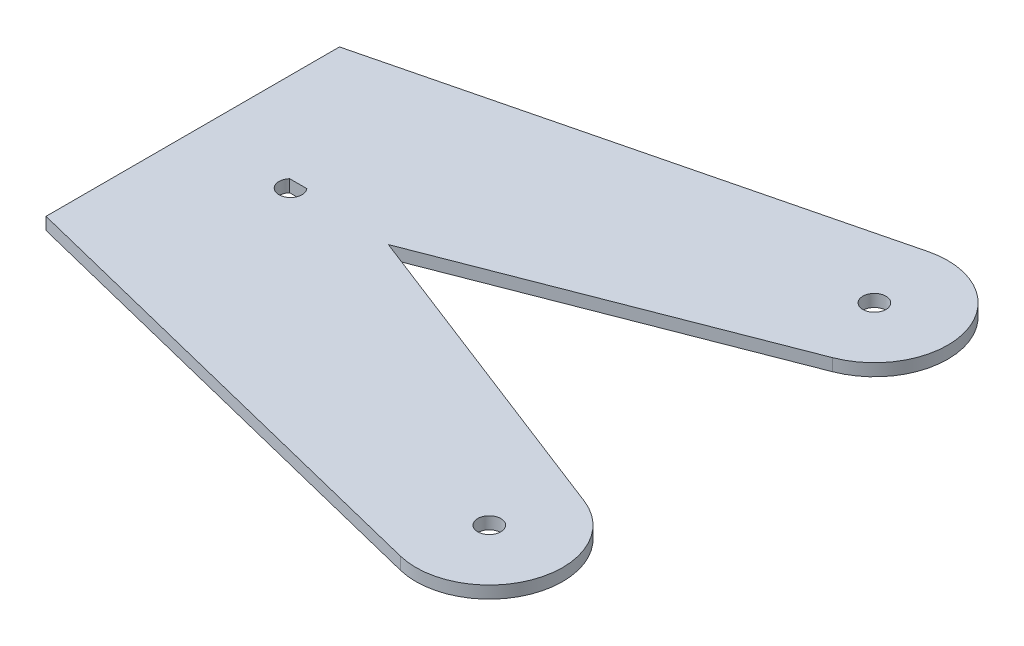
ISO-10303-21;
HEADER;
FILE_DESCRIPTION(('STEP AP214'),'2;1');
FILE_NAME('part.step','',(''),(''),'','','');
FILE_SCHEMA(('AUTOMOTIVE_DESIGN { 1 0 10303 214 1 1 1 1 }'));
ENDSEC;
DATA;
#1=APPLICATION_CONTEXT('core data for automotive mechanical design processes');
#2=APPLICATION_PROTOCOL_DEFINITION('international standard','automotive_design',2000,#1);
#3=PRODUCT_CONTEXT('',#1,'mechanical');
#4=PRODUCT('Part','Part','',(#3));
#5=PRODUCT_RELATED_PRODUCT_CATEGORY('part','',(#4));
#6=PRODUCT_DEFINITION_FORMATION('','',#4);
#7=PRODUCT_DEFINITION_CONTEXT('part definition',#1,'design');
#8=PRODUCT_DEFINITION('design','',#6,#7);
#9=PRODUCT_DEFINITION_SHAPE('','',#8);
#10=(LENGTH_UNIT() NAMED_UNIT(*) SI_UNIT(.MILLI.,.METRE.));
#11=(NAMED_UNIT(*) PLANE_ANGLE_UNIT() SI_UNIT($,.RADIAN.));
#12=(NAMED_UNIT(*) SI_UNIT($,.STERADIAN.) SOLID_ANGLE_UNIT());
#13=UNCERTAINTY_MEASURE_WITH_UNIT(LENGTH_MEASURE(1.E-05),#10,'distance_accuracy_value','');
#14=(GEOMETRIC_REPRESENTATION_CONTEXT(3) GLOBAL_UNCERTAINTY_ASSIGNED_CONTEXT((#13)) GLOBAL_UNIT_ASSIGNED_CONTEXT((#10,
#11,#12)) REPRESENTATION_CONTEXT('',''));
#15=CARTESIAN_POINT('',(0.,0.,0.));
#16=DIRECTION('',(0.,0.,1.));
#17=DIRECTION('',(1.,0.,0.));
#18=AXIS2_PLACEMENT_3D('',#15,#16,#17);
#19=CARTESIAN_POINT('',(0.,1.5875,-2.));
#20=DIRECTION('',(0.,0.,-1.));
#21=DIRECTION('',(-1.,0.,0.));
#22=AXIS2_PLACEMENT_3D('',#19,#20,#21);
#23=PLANE('',#22);
#24=DIRECTION('',(1.,0.,0.));
#25=VECTOR('',#24,1.);
#26=CARTESIAN_POINT('',(0.,-1.5875,-2.));
#27=LINE('',#26,#25);
#28=CARTESIAN_POINT('',(-2.23606797749979,-1.5875,-2.));
#29=VERTEX_POINT('',#28);
#30=CARTESIAN_POINT('',(2.23606797749979,-1.5875,-2.));
#31=VERTEX_POINT('',#30);
#32=EDGE_CURVE('E144',#29,#31,#27,.T.);
#33=ORIENTED_EDGE('',*,*,#32,.T.);
#34=DIRECTION('',(0.,-1.,0.));
#35=VECTOR('',#34,1.);
#36=CARTESIAN_POINT('',(2.23606797749979,1.5875,-2.));
#37=LINE('',#36,#35);
#38=CARTESIAN_POINT('',(2.23606797749979,1.5875,-2.));
#39=VERTEX_POINT('',#38);
#40=EDGE_CURVE('E11',#39,#31,#37,.T.);
#41=ORIENTED_EDGE('',*,*,#40,.F.);
#42=DIRECTION('',(1.,0.,0.));
#43=VECTOR('',#42,1.);
#44=CARTESIAN_POINT('',(0.,1.5875,-2.));
#45=LINE('',#44,#43);
#46=CARTESIAN_POINT('',(-2.23606797749979,1.5875,-2.));
#47=VERTEX_POINT('',#46);
#48=EDGE_CURVE('E160',#47,#39,#45,.T.);
#49=ORIENTED_EDGE('',*,*,#48,.F.);
#50=DIRECTION('',(0.,-1.,0.));
#51=VECTOR('',#50,1.);
#52=CARTESIAN_POINT('',(-2.23606797749979,1.5875,-2.));
#53=LINE('',#52,#51);
#54=EDGE_CURVE('E51',#47,#29,#53,.T.);
#55=ORIENTED_EDGE('',*,*,#54,.T.);
#56=EDGE_LOOP('',(#33,#41,#49,#55));
#57=FACE_BOUND('',#56,.T.);
#58=ADVANCED_FACE('F41',(#57),#23,.F.);
#59=CARTESIAN_POINT('',(101.6,1.5875,50.));
#60=DIRECTION('',(0.,-1.,0.));
#61=DIRECTION('',(0.,0.,-1.));
#62=AXIS2_PLACEMENT_3D('',#59,#60,#61);
#63=CYLINDRICAL_SURFACE('',#62,19.05);
#64=CARTESIAN_POINT('',(101.6,-1.5875,50.));
#65=DIRECTION('',(0.,1.,0.));
#66=DIRECTION('',(0.,0.,1.));
#67=AXIS2_PLACEMENT_3D('',#64,#65,#66);
#68=CIRCLE('',#67,19.05);
#69=CARTESIAN_POINT('',(108.491020074045,-1.5875,32.240035407155));
#70=VERTEX_POINT('',#69);
#71=CARTESIAN_POINT('',(97.0100862345687,-1.5875,68.4887855638467));
#72=VERTEX_POINT('',#71);
#73=EDGE_CURVE('E163',#70,#72,#68,.F.);
#74=ORIENTED_EDGE('',*,*,#73,.F.);
#75=DIRECTION('',(0.,-1.,0.));
#76=VECTOR('',#75,1.);
#77=CARTESIAN_POINT('',(108.491020074045,1.5875,32.240035407155));
#78=LINE('',#77,#76);
#79=CARTESIAN_POINT('',(108.491020074045,1.5875,32.240035407155));
#80=VERTEX_POINT('',#79);
#81=EDGE_CURVE('E45',#80,#70,#78,.T.);
#82=ORIENTED_EDGE('',*,*,#81,.F.);
#83=CARTESIAN_POINT('',(101.6,1.5875,50.));
#84=DIRECTION('',(0.,1.,0.));
#85=DIRECTION('',(0.,0.,1.));
#86=AXIS2_PLACEMENT_3D('',#83,#84,#85);
#87=CIRCLE('',#86,19.05);
#88=CARTESIAN_POINT('',(97.0100862345687,1.5875,68.4887855638467));
#89=VERTEX_POINT('',#88);
#90=EDGE_CURVE('E123',#80,#89,#87,.F.);
#91=ORIENTED_EDGE('',*,*,#90,.T.);
#92=DIRECTION('',(0.,-1.,0.));
#93=VECTOR('',#92,1.);
#94=CARTESIAN_POINT('',(97.0100862345687,1.5875,68.4887855638467));
#95=LINE('',#94,#93);
#96=EDGE_CURVE('E133',#89,#72,#95,.T.);
#97=ORIENTED_EDGE('',*,*,#96,.T.);
#98=EDGE_LOOP('',(#74,#82,#91,#97));
#99=FACE_BOUND('',#98,.T.);
#100=ADVANCED_FACE('F43',(#99),#63,.T.);
#101=CARTESIAN_POINT('',(3.32361558431457,1.5875,-8.56582834811038));
#102=DIRECTION('',(-0.361733337220222,0.,0.932281605923619));
#103=DIRECTION('',(0.932281605923619,0.,0.361733337220222));
#104=AXIS2_PLACEMENT_3D('',#101,#102,#103);
#105=PLANE('',#104);
#106=DIRECTION('',(-0.932281605923619,0.,-0.361733337220222));
#107=VECTOR('',#106,1.);
#108=CARTESIAN_POINT('',(3.32361558431457,-1.5875,-8.56582834811038));
#109=LINE('',#108,#107);
#110=CARTESIAN_POINT('',(25.4,-1.5875,0.));
#111=VERTEX_POINT('',#110);
#112=EDGE_CURVE('E165',#70,#111,#109,.T.);
#113=ORIENTED_EDGE('',*,*,#112,.T.);
#114=DIRECTION('',(0.,-1.,0.));
#115=VECTOR('',#114,1.);
#116=CARTESIAN_POINT('',(25.4,1.5875,0.));
#117=LINE('',#116,#115);
#118=CARTESIAN_POINT('',(25.4,1.5875,0.));
#119=VERTEX_POINT('',#118);
#120=EDGE_CURVE('E194',#119,#111,#117,.T.);
#121=ORIENTED_EDGE('',*,*,#120,.F.);
#122=DIRECTION('',(-0.932281605923619,0.,-0.361733337220222));
#123=VECTOR('',#122,1.);
#124=CARTESIAN_POINT('',(3.32361558431457,1.5875,-8.56582834811038));
#125=LINE('',#124,#123);
#126=EDGE_CURVE('E140',#80,#119,#125,.T.);
#127=ORIENTED_EDGE('',*,*,#126,.F.);
#128=ORIENTED_EDGE('',*,*,#81,.T.);
#129=EDGE_LOOP('',(#113,#121,#127,#128));
#130=FACE_BOUND('',#129,.T.);
#131=ADVANCED_FACE('F202',(#130),#105,.F.);
#132=CARTESIAN_POINT('',(3.32361558431456,1.5875,8.56582834811037));
#133=DIRECTION('',(-0.361733337220222,0.,-0.932281605923619));
#134=DIRECTION('',(-0.932281605923619,0.,0.361733337220222));
#135=AXIS2_PLACEMENT_3D('',#132,#133,#134);
#136=PLANE('',#135);
#137=DIRECTION('',(0.932281605923619,0.,-0.361733337220222));
#138=VECTOR('',#137,1.);
#139=CARTESIAN_POINT('',(3.32361558431456,-1.5875,8.56582834811037));
#140=LINE('',#139,#138);
#141=CARTESIAN_POINT('',(108.491020074045,-1.5875,-32.2400354071551));
#142=VERTEX_POINT('',#141);
#143=EDGE_CURVE('E167',#111,#142,#140,.T.);
#144=ORIENTED_EDGE('',*,*,#143,.T.);
#145=DIRECTION('',(0.,-1.,0.));
#146=VECTOR('',#145,1.);
#147=CARTESIAN_POINT('',(108.491020074045,1.5875,-32.2400354071551));
#148=LINE('',#147,#146);
#149=CARTESIAN_POINT('',(108.491020074045,1.5875,-32.2400354071551));
#150=VERTEX_POINT('',#149);
#151=EDGE_CURVE('E193',#150,#142,#148,.T.);
#152=ORIENTED_EDGE('',*,*,#151,.F.);
#153=DIRECTION('',(0.932281605923619,0.,-0.361733337220222));
#154=VECTOR('',#153,1.);
#155=CARTESIAN_POINT('',(3.32361558431456,1.5875,8.56582834811037));
#156=LINE('',#155,#154);
#157=EDGE_CURVE('E142',#119,#150,#156,.T.);
#158=ORIENTED_EDGE('',*,*,#157,.F.);
#159=ORIENTED_EDGE('',*,*,#120,.T.);
#160=EDGE_LOOP('',(#144,#152,#158,#159));
#161=FACE_BOUND('',#160,.T.);
#162=ADVANCED_FACE('F208',(#161),#136,.F.);
#163=CARTESIAN_POINT('',(101.6,1.5875,-50.));
#164=DIRECTION('',(0.,-1.,0.));
#165=DIRECTION('',(0.,0.,-1.));
#166=AXIS2_PLACEMENT_3D('',#163,#164,#165);
#167=CYLINDRICAL_SURFACE('',#166,19.05);
#168=CARTESIAN_POINT('',(101.6,-1.5875,-50.));
#169=DIRECTION('',(0.,1.,0.));
#170=DIRECTION('',(0.,0.,1.));
#171=AXIS2_PLACEMENT_3D('',#168,#169,#170);
#172=CIRCLE('',#171,19.05);
#173=CARTESIAN_POINT('',(97.0100862345687,-1.5875,-68.4887855638467));
#174=VERTEX_POINT('',#173);
#175=EDGE_CURVE('E170',#174,#142,#172,.F.);
#176=ORIENTED_EDGE('',*,*,#175,.F.);
#177=DIRECTION('',(0.,-1.,0.));
#178=VECTOR('',#177,1.);
#179=CARTESIAN_POINT('',(97.0100862345687,1.5875,-68.4887855638467));
#180=LINE('',#179,#178);
#181=CARTESIAN_POINT('',(97.0100862345687,1.5875,-68.4887855638467));
#182=VERTEX_POINT('',#181);
#183=EDGE_CURVE('E191',#182,#174,#180,.T.);
#184=ORIENTED_EDGE('',*,*,#183,.F.);
#185=CARTESIAN_POINT('',(101.6,1.5875,-50.));
#186=DIRECTION('',(0.,1.,0.));
#187=DIRECTION('',(0.,0.,1.));
#188=AXIS2_PLACEMENT_3D('',#185,#186,#187);
#189=CIRCLE('',#188,19.05);
#190=EDGE_CURVE('E148',#182,#150,#189,.F.);
#191=ORIENTED_EDGE('',*,*,#190,.T.);
#192=ORIENTED_EDGE('',*,*,#151,.T.);
#193=EDGE_LOOP('',(#176,#184,#191,#192));
#194=FACE_BOUND('',#193,.T.);
#195=ADVANCED_FACE('F211',(#194),#167,.T.);
#196=CARTESIAN_POINT('',(-10.3839163900267,1.5875,-41.8278018410823));
#197=DIRECTION('',(-0.240940355140751,0.,-0.970539924611373));
#198=DIRECTION('',(-0.970539924611373,0.,0.240940355140751));
#199=AXIS2_PLACEMENT_3D('',#196,#197,#198);
#200=PLANE('',#199);
#201=DIRECTION('',(0.970539924611373,0.,-0.240940355140751));
#202=VECTOR('',#201,1.);
#203=CARTESIAN_POINT('',(-10.3839163900267,-1.5875,-41.8278018410823));
#204=LINE('',#203,#202);
#205=CARTESIAN_POINT('',(-25.4,-1.5875,-38.1));
#206=VERTEX_POINT('',#205);
#207=EDGE_CURVE('E173',#206,#174,#204,.T.);
#208=ORIENTED_EDGE('',*,*,#207,.F.);
#209=DIRECTION('',(0.,-1.,0.));
#210=VECTOR('',#209,1.);
#211=CARTESIAN_POINT('',(-25.4,1.5875,-38.1));
#212=LINE('',#211,#210);
#213=CARTESIAN_POINT('',(-25.4,1.5875,-38.1));
#214=VERTEX_POINT('',#213);
#215=EDGE_CURVE('E189',#214,#206,#212,.T.);
#216=ORIENTED_EDGE('',*,*,#215,.F.);
#217=DIRECTION('',(0.970539924611373,0.,-0.240940355140751));
#218=VECTOR('',#217,1.);
#219=CARTESIAN_POINT('',(-10.3839163900267,1.5875,-41.8278018410823));
#220=LINE('',#219,#218);
#221=EDGE_CURVE('E151',#214,#182,#220,.T.);
#222=ORIENTED_EDGE('',*,*,#221,.T.);
#223=ORIENTED_EDGE('',*,*,#183,.T.);
#224=EDGE_LOOP('',(#208,#216,#222,#223));
#225=FACE_BOUND('',#224,.T.);
#226=ADVANCED_FACE('F214',(#225),#200,.T.);
#227=CARTESIAN_POINT('',(-25.4,1.5875,0.));
#228=DIRECTION('',(1.,0.,0.));
#229=DIRECTION('',(0.,0.,-1.));
#230=AXIS2_PLACEMENT_3D('',#227,#228,#229);
#231=PLANE('',#230);
#232=DIRECTION('',(0.,0.,1.));
#233=VECTOR('',#232,1.);
#234=CARTESIAN_POINT('',(-25.4,-1.5875,0.));
#235=LINE('',#234,#233);
#236=CARTESIAN_POINT('',(-25.4,-1.5875,38.1));
#237=VERTEX_POINT('',#236);
#238=EDGE_CURVE('E176',#206,#237,#235,.T.);
#239=ORIENTED_EDGE('',*,*,#238,.T.);
#240=DIRECTION('',(0.,-1.,0.));
#241=VECTOR('',#240,1.);
#242=CARTESIAN_POINT('',(-25.4,1.5875,38.1));
#243=LINE('',#242,#241);
#244=CARTESIAN_POINT('',(-25.4,1.5875,38.1));
#245=VERTEX_POINT('',#244);
#246=EDGE_CURVE('E138',#245,#237,#243,.T.);
#247=ORIENTED_EDGE('',*,*,#246,.F.);
#248=DIRECTION('',(0.,0.,1.));
#249=VECTOR('',#248,1.);
#250=CARTESIAN_POINT('',(-25.4,1.5875,0.));
#251=LINE('',#250,#249);
#252=EDGE_CURVE('E126',#214,#245,#251,.T.);
#253=ORIENTED_EDGE('',*,*,#252,.F.);
#254=ORIENTED_EDGE('',*,*,#215,.T.);
#255=EDGE_LOOP('',(#239,#247,#253,#254));
#256=FACE_BOUND('',#255,.T.);
#257=ADVANCED_FACE('F217',(#256),#231,.F.);
#258=CARTESIAN_POINT('',(101.6,1.5875,50.));
#259=DIRECTION('',(0.,-1.,0.));
#260=DIRECTION('',(0.,0.,-1.));
#261=AXIS2_PLACEMENT_3D('',#258,#259,#260);
#262=CYLINDRICAL_SURFACE('',#261,3.00000000000001);
#263=CARTESIAN_POINT('',(101.6,1.5875,50.));
#264=DIRECTION('',(0.,1.,0.));
#265=DIRECTION('',(0.,0.,1.));
#266=AXIS2_PLACEMENT_3D('',#263,#264,#265);
#267=CIRCLE('',#266,3.00000000000001);
#268=CARTESIAN_POINT('',(101.6,1.5875,53.));
#269=VERTEX_POINT('',#268);
#270=EDGE_CURVE('E157',#269,#269,#267,.T.);
#271=ORIENTED_EDGE('',*,*,#270,.T.);
#272=EDGE_LOOP('',(#271));
#273=FACE_BOUND('',#272,.T.);
#274=CARTESIAN_POINT('',(101.6,-1.5875,50.));
#275=DIRECTION('',(0.,1.,0.));
#276=DIRECTION('',(0.,0.,1.));
#277=AXIS2_PLACEMENT_3D('',#274,#275,#276);
#278=CIRCLE('',#277,3.00000000000001);
#279=CARTESIAN_POINT('',(101.6,-1.5875,53.));
#280=VERTEX_POINT('',#279);
#281=EDGE_CURVE('E182',#280,#280,#278,.T.);
#282=ORIENTED_EDGE('',*,*,#281,.F.);
#283=EDGE_LOOP('',(#282));
#284=FACE_BOUND('',#283,.T.);
#285=ADVANCED_FACE('F219',(#273,#284),#262,.F.);
#286=CARTESIAN_POINT('',(101.6,1.5875,-50.));
#287=DIRECTION('',(0.,-1.,0.));
#288=DIRECTION('',(0.,0.,-1.));
#289=AXIS2_PLACEMENT_3D('',#286,#287,#288);
#290=CYLINDRICAL_SURFACE('',#289,3.00000000000001);
#291=CARTESIAN_POINT('',(101.6,1.5875,-50.));
#292=DIRECTION('',(0.,1.,0.));
#293=DIRECTION('',(0.,0.,1.));
#294=AXIS2_PLACEMENT_3D('',#291,#292,#293);
#295=CIRCLE('',#294,3.00000000000001);
#296=CARTESIAN_POINT('',(101.6,1.5875,-47.));
#297=VERTEX_POINT('',#296);
#298=EDGE_CURVE('E130',#297,#297,#295,.T.);
#299=ORIENTED_EDGE('',*,*,#298,.T.);
#300=EDGE_LOOP('',(#299));
#301=FACE_BOUND('',#300,.T.);
#302=CARTESIAN_POINT('',(101.6,-1.5875,-50.));
#303=DIRECTION('',(0.,1.,0.));
#304=DIRECTION('',(0.,0.,1.));
#305=AXIS2_PLACEMENT_3D('',#302,#303,#304);
#306=CIRCLE('',#305,3.00000000000001);
#307=CARTESIAN_POINT('',(101.6,-1.5875,-47.));
#308=VERTEX_POINT('',#307);
#309=EDGE_CURVE('E179',#308,#308,#306,.T.);
#310=ORIENTED_EDGE('',*,*,#309,.F.);
#311=EDGE_LOOP('',(#310));
#312=FACE_BOUND('',#311,.T.);
#313=ADVANCED_FACE('F225',(#301,#312),#290,.F.);
#314=CARTESIAN_POINT('',(-10.3839163900267,1.5875,41.8278018410823));
#315=DIRECTION('',(0.240940355140751,0.,-0.970539924611373));
#316=DIRECTION('',(-0.970539924611373,0.,-0.240940355140751));
#317=AXIS2_PLACEMENT_3D('',#314,#315,#316);
#318=PLANE('',#317);
#319=DIRECTION('',(0.970539924611373,0.,0.240940355140751));
#320=VECTOR('',#319,1.);
#321=CARTESIAN_POINT('',(-10.3839163900267,-1.5875,41.8278018410823));
#322=LINE('',#321,#320);
#323=EDGE_CURVE('E136',#237,#72,#322,.T.);
#324=ORIENTED_EDGE('',*,*,#323,.T.);
#325=ORIENTED_EDGE('',*,*,#96,.F.);
#326=DIRECTION('',(0.970539924611373,0.,0.240940355140751));
#327=VECTOR('',#326,1.);
#328=CARTESIAN_POINT('',(-10.3839163900267,1.5875,41.8278018410823));
#329=LINE('',#328,#327);
#330=EDGE_CURVE('E119',#245,#89,#329,.T.);
#331=ORIENTED_EDGE('',*,*,#330,.F.);
#332=ORIENTED_EDGE('',*,*,#246,.T.);
#333=EDGE_LOOP('',(#324,#325,#331,#332));
#334=FACE_BOUND('',#333,.T.);
#335=ADVANCED_FACE('F134',(#334),#318,.F.);
#336=CARTESIAN_POINT('',(0.,1.5875,0.));
#337=DIRECTION('',(0.,-1.,0.));
#338=DIRECTION('',(0.,0.,-1.));
#339=AXIS2_PLACEMENT_3D('',#336,#337,#338);
#340=CYLINDRICAL_SURFACE('',#339,3.);
#341=CARTESIAN_POINT('',(0.,-1.5875,0.));
#342=DIRECTION('',(0.,1.,0.));
#343=DIRECTION('',(0.,0.,1.));
#344=AXIS2_PLACEMENT_3D('',#341,#342,#343);
#345=CIRCLE('',#344,3.);
#346=EDGE_CURVE('E90',#31,#29,#345,.F.);
#347=ORIENTED_EDGE('',*,*,#346,.T.);
#348=ORIENTED_EDGE('',*,*,#54,.F.);
#349=CARTESIAN_POINT('',(0.,1.5875,0.));
#350=DIRECTION('',(0.,1.,0.));
#351=DIRECTION('',(0.,0.,1.));
#352=AXIS2_PLACEMENT_3D('',#349,#350,#351);
#353=CIRCLE('',#352,3.);
#354=EDGE_CURVE('E59',#39,#47,#353,.F.);
#355=ORIENTED_EDGE('',*,*,#354,.F.);
#356=ORIENTED_EDGE('',*,*,#40,.T.);
#357=EDGE_LOOP('',(#347,#348,#355,#356));
#358=FACE_BOUND('',#357,.T.);
#359=ADVANCED_FACE('F237',(#358),#340,.F.);
#360=CARTESIAN_POINT('',(0.,1.5875,0.));
#361=DIRECTION('',(0.,1.,0.));
#362=DIRECTION('',(0.,0.,1.));
#363=AXIS2_PLACEMENT_3D('',#360,#361,#362);
#364=PLANE('',#363);
#365=ORIENTED_EDGE('',*,*,#90,.F.);
#366=ORIENTED_EDGE('',*,*,#126,.T.);
#367=ORIENTED_EDGE('',*,*,#157,.T.);
#368=ORIENTED_EDGE('',*,*,#190,.F.);
#369=ORIENTED_EDGE('',*,*,#221,.F.);
#370=ORIENTED_EDGE('',*,*,#252,.T.);
#371=ORIENTED_EDGE('',*,*,#330,.T.);
#372=EDGE_LOOP('',(#365,#366,#367,#368,#369,#370,#371));
#373=FACE_BOUND('',#372,.T.);
#374=ORIENTED_EDGE('',*,*,#298,.F.);
#375=EDGE_LOOP('',(#374));
#376=FACE_BOUND('',#375,.T.);
#377=ORIENTED_EDGE('',*,*,#270,.F.);
#378=EDGE_LOOP('',(#377));
#379=FACE_BOUND('',#378,.T.);
#380=ORIENTED_EDGE('',*,*,#48,.T.);
#381=ORIENTED_EDGE('',*,*,#354,.T.);
#382=EDGE_LOOP('',(#380,#381));
#383=FACE_BOUND('',#382,.T.);
#384=ADVANCED_FACE('F121',(#373,#376,#379,#383),#364,.T.);
#385=CARTESIAN_POINT('',(0.,-1.5875,0.));
#386=DIRECTION('',(0.,1.,0.));
#387=DIRECTION('',(0.,0.,1.));
#388=AXIS2_PLACEMENT_3D('',#385,#386,#387);
#389=PLANE('',#388);
#390=ORIENTED_EDGE('',*,*,#73,.T.);
#391=ORIENTED_EDGE('',*,*,#323,.F.);
#392=ORIENTED_EDGE('',*,*,#238,.F.);
#393=ORIENTED_EDGE('',*,*,#207,.T.);
#394=ORIENTED_EDGE('',*,*,#175,.T.);
#395=ORIENTED_EDGE('',*,*,#143,.F.);
#396=ORIENTED_EDGE('',*,*,#112,.F.);
#397=EDGE_LOOP('',(#390,#391,#392,#393,#394,#395,#396));
#398=FACE_BOUND('',#397,.T.);
#399=ORIENTED_EDGE('',*,*,#309,.T.);
#400=EDGE_LOOP('',(#399));
#401=FACE_BOUND('',#400,.T.);
#402=ORIENTED_EDGE('',*,*,#281,.T.);
#403=EDGE_LOOP('',(#402));
#404=FACE_BOUND('',#403,.T.);
#405=ORIENTED_EDGE('',*,*,#32,.F.);
#406=ORIENTED_EDGE('',*,*,#346,.F.);
#407=EDGE_LOOP('',(#405,#406));
#408=FACE_BOUND('',#407,.T.);
#409=ADVANCED_FACE('F204',(#398,#401,#404,#408),#389,.F.);
#410=CLOSED_SHELL('',(#58,#100,#131,#162,#195,#226,#257,#285,#313,#335,#359,#384,#409));
#411=MANIFOLD_SOLID_BREP('B2',#410);
#412=ADVANCED_BREP_SHAPE_REPRESENTATION('',(#18,#411),#14);
#413=SHAPE_DEFINITION_REPRESENTATION(#9,#412);
ENDSEC;
END-ISO-10303-21;
